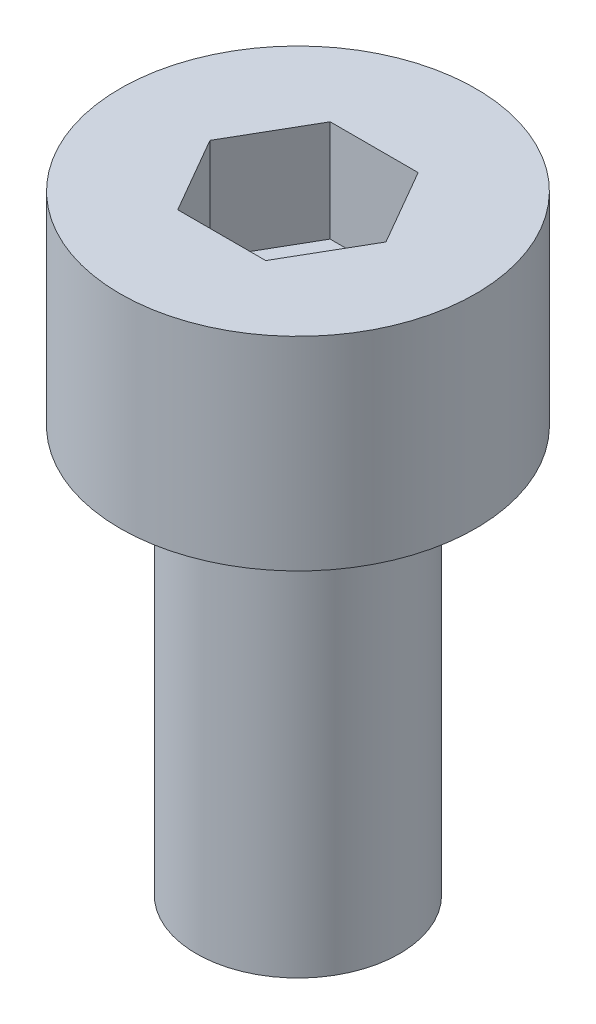
ISO-10303-21;
HEADER;
FILE_DESCRIPTION(('STEP AP214'),'2;1');
FILE_NAME('part.step','',(''),(''),'','','');
FILE_SCHEMA(('AUTOMOTIVE_DESIGN { 1 0 10303 214 1 1 1 1 }'));
ENDSEC;
DATA;
#1=APPLICATION_CONTEXT('core data for automotive mechanical design processes');
#2=APPLICATION_PROTOCOL_DEFINITION('international standard','automotive_design',2000,#1);
#3=PRODUCT_CONTEXT('',#1,'mechanical');
#4=PRODUCT('Part','Part','',(#3));
#5=PRODUCT_RELATED_PRODUCT_CATEGORY('part','',(#4));
#6=PRODUCT_DEFINITION_FORMATION('','',#4);
#7=PRODUCT_DEFINITION_CONTEXT('part definition',#1,'design');
#8=PRODUCT_DEFINITION('design','',#6,#7);
#9=PRODUCT_DEFINITION_SHAPE('','',#8);
#10=(LENGTH_UNIT() NAMED_UNIT(*) SI_UNIT(.MILLI.,.METRE.));
#11=(NAMED_UNIT(*) PLANE_ANGLE_UNIT() SI_UNIT($,.RADIAN.));
#12=(NAMED_UNIT(*) SI_UNIT($,.STERADIAN.) SOLID_ANGLE_UNIT());
#13=UNCERTAINTY_MEASURE_WITH_UNIT(LENGTH_MEASURE(1.E-05),#10,'distance_accuracy_value','');
#14=(GEOMETRIC_REPRESENTATION_CONTEXT(3) GLOBAL_UNCERTAINTY_ASSIGNED_CONTEXT((#13)) GLOBAL_UNIT_ASSIGNED_CONTEXT((#10,
#11,#12)) REPRESENTATION_CONTEXT('',''));
#15=CARTESIAN_POINT('',(0.,0.,0.));
#16=DIRECTION('',(0.,0.,1.));
#17=DIRECTION('',(1.,0.,0.));
#18=AXIS2_PLACEMENT_3D('',#15,#16,#17);
#19=CARTESIAN_POINT('',(0.,4.,0.));
#20=DIRECTION('',(0.,-1.,0.));
#21=DIRECTION('',(0.,0.,-1.));
#22=AXIS2_PLACEMENT_3D('',#19,#20,#21);
#23=CYLINDRICAL_SURFACE('',#22,3.5);
#24=CARTESIAN_POINT('',(0.,4.,0.));
#25=DIRECTION('',(0.,1.,0.));
#26=DIRECTION('',(0.,0.,1.));
#27=AXIS2_PLACEMENT_3D('',#24,#25,#26);
#28=CIRCLE('',#27,3.5);
#29=CARTESIAN_POINT('',(0.,4.,3.5));
#30=VERTEX_POINT('',#29);
#31=EDGE_CURVE('E43',#30,#30,#28,.T.);
#32=ORIENTED_EDGE('',*,*,#31,.F.);
#33=EDGE_LOOP('',(#32));
#34=FACE_BOUND('',#33,.T.);
#35=CARTESIAN_POINT('',(0.,0.,0.));
#36=DIRECTION('',(0.,1.,0.));
#37=DIRECTION('',(0.,0.,1.));
#38=AXIS2_PLACEMENT_3D('',#35,#36,#37);
#39=CIRCLE('',#38,3.5);
#40=CARTESIAN_POINT('',(0.,0.,3.5));
#41=VERTEX_POINT('',#40);
#42=EDGE_CURVE('E38',#41,#41,#39,.T.);
#43=ORIENTED_EDGE('',*,*,#42,.T.);
#44=EDGE_LOOP('',(#43));
#45=FACE_BOUND('',#44,.T.);
#46=ADVANCED_FACE('F35',(#34,#45),#23,.T.);
#47=CARTESIAN_POINT('',(0.,4.,0.));
#48=DIRECTION('',(0.,1.,0.));
#49=DIRECTION('',(0.,0.,1.));
#50=AXIS2_PLACEMENT_3D('',#47,#48,#49);
#51=PLANE('',#50);
#52=DIRECTION('',(0.5,0.,-0.866025403784439));
#53=VECTOR('',#52,1.);
#54=CARTESIAN_POINT('',(0.866025403784438,4.,1.5));
#55=LINE('',#54,#53);
#56=CARTESIAN_POINT('',(0.866025403784438,4.,1.5));
#57=VERTEX_POINT('',#56);
#58=CARTESIAN_POINT('',(1.73205080756888,4.,0.));
#59=VERTEX_POINT('',#58);
#60=EDGE_CURVE('E51',#57,#59,#55,.T.);
#61=ORIENTED_EDGE('',*,*,#60,.F.);
#62=DIRECTION('',(1.,0.,0.));
#63=VECTOR('',#62,1.);
#64=CARTESIAN_POINT('',(-0.866025403784439,4.,1.5));
#65=LINE('',#64,#63);
#66=CARTESIAN_POINT('',(-0.866025403784439,4.,1.5));
#67=VERTEX_POINT('',#66);
#68=EDGE_CURVE('E135',#67,#57,#65,.T.);
#69=ORIENTED_EDGE('',*,*,#68,.F.);
#70=DIRECTION('',(0.5,0.,0.866025403784438));
#71=VECTOR('',#70,1.);
#72=CARTESIAN_POINT('',(-1.73205080756888,4.,0.));
#73=LINE('',#72,#71);
#74=CARTESIAN_POINT('',(-1.73205080756888,4.,0.));
#75=VERTEX_POINT('',#74);
#76=EDGE_CURVE('E133',#75,#67,#73,.T.);
#77=ORIENTED_EDGE('',*,*,#76,.F.);
#78=DIRECTION('',(-0.5,0.,0.866025403784439));
#79=VECTOR('',#78,1.);
#80=CARTESIAN_POINT('',(-0.866025403784439,4.,-1.5));
#81=LINE('',#80,#79);
#82=CARTESIAN_POINT('',(-0.866025403784439,4.,-1.5));
#83=VERTEX_POINT('',#82);
#84=EDGE_CURVE('E99',#83,#75,#81,.T.);
#85=ORIENTED_EDGE('',*,*,#84,.F.);
#86=DIRECTION('',(-1.,0.,0.));
#87=VECTOR('',#86,1.);
#88=CARTESIAN_POINT('',(0.866025403784438,4.,-1.5));
#89=LINE('',#88,#87);
#90=CARTESIAN_POINT('',(0.866025403784438,4.,-1.5));
#91=VERTEX_POINT('',#90);
#92=EDGE_CURVE('E129',#91,#83,#89,.T.);
#93=ORIENTED_EDGE('',*,*,#92,.F.);
#94=DIRECTION('',(-0.5,0.,-0.866025403784439));
#95=VECTOR('',#94,1.);
#96=CARTESIAN_POINT('',(1.73205080756888,4.,0.));
#97=LINE('',#96,#95);
#98=EDGE_CURVE('E125',#59,#91,#97,.T.);
#99=ORIENTED_EDGE('',*,*,#98,.F.);
#100=EDGE_LOOP('',(#61,#69,#77,#85,#93,#99));
#101=FACE_BOUND('',#100,.T.);
#102=ORIENTED_EDGE('',*,*,#31,.T.);
#103=EDGE_LOOP('',(#102));
#104=FACE_BOUND('',#103,.T.);
#105=ADVANCED_FACE('F153',(#101,#104),#51,.T.);
#106=CARTESIAN_POINT('',(0.,0.,0.));
#107=DIRECTION('',(0.,1.,0.));
#108=DIRECTION('',(0.,0.,1.));
#109=AXIS2_PLACEMENT_3D('',#106,#107,#108);
#110=PLANE('',#109);
#111=CARTESIAN_POINT('',(0.,0.,0.));
#112=DIRECTION('',(0.,-1.,0.));
#113=DIRECTION('',(0.,0.,-1.));
#114=AXIS2_PLACEMENT_3D('',#111,#112,#113);
#115=CIRCLE('',#114,2.);
#116=CARTESIAN_POINT('',(0.,0.,-2.));
#117=VERTEX_POINT('',#116);
#118=EDGE_CURVE('E11',#117,#117,#115,.T.);
#119=ORIENTED_EDGE('',*,*,#118,.F.);
#120=EDGE_LOOP('',(#119));
#121=FACE_BOUND('',#120,.T.);
#122=ORIENTED_EDGE('',*,*,#42,.F.);
#123=EDGE_LOOP('',(#122));
#124=FACE_BOUND('',#123,.T.);
#125=ADVANCED_FACE('F150',(#121,#124),#110,.F.);
#126=CARTESIAN_POINT('',(0.866025403784438,2.,1.5));
#127=DIRECTION('',(0.866025403784439,0.,0.5));
#128=DIRECTION('',(0.5,0.,-0.866025403784439));
#129=AXIS2_PLACEMENT_3D('',#126,#127,#128);
#130=PLANE('',#129);
#131=ORIENTED_EDGE('',*,*,#60,.T.);
#132=DIRECTION('',(0.,1.,0.));
#133=VECTOR('',#132,1.);
#134=CARTESIAN_POINT('',(1.73205080756888,2.,0.));
#135=LINE('',#134,#133);
#136=CARTESIAN_POINT('',(1.73205080756888,2.,0.));
#137=VERTEX_POINT('',#136);
#138=EDGE_CURVE('E81',#137,#59,#135,.T.);
#139=ORIENTED_EDGE('',*,*,#138,.F.);
#140=DIRECTION('',(0.5,0.,-0.866025403784439));
#141=VECTOR('',#140,1.);
#142=CARTESIAN_POINT('',(0.866025403784438,2.,1.5));
#143=LINE('',#142,#141);
#144=CARTESIAN_POINT('',(0.866025403784438,2.,1.5));
#145=VERTEX_POINT('',#144);
#146=EDGE_CURVE('E137',#145,#137,#143,.T.);
#147=ORIENTED_EDGE('',*,*,#146,.F.);
#148=DIRECTION('',(0.,1.,0.));
#149=VECTOR('',#148,1.);
#150=CARTESIAN_POINT('',(0.866025403784438,2.,1.5));
#151=LINE('',#150,#149);
#152=EDGE_CURVE('E59',#145,#57,#151,.T.);
#153=ORIENTED_EDGE('',*,*,#152,.T.);
#154=EDGE_LOOP('',(#131,#139,#147,#153));
#155=FACE_BOUND('',#154,.T.);
#156=ADVANCED_FACE('F152',(#155),#130,.F.);
#157=CARTESIAN_POINT('',(-0.866025403784439,2.,1.5));
#158=DIRECTION('',(0.,0.,1.));
#159=DIRECTION('',(1.,0.,0.));
#160=AXIS2_PLACEMENT_3D('',#157,#158,#159);
#161=PLANE('',#160);
#162=ORIENTED_EDGE('',*,*,#68,.T.);
#163=ORIENTED_EDGE('',*,*,#152,.F.);
#164=DIRECTION('',(1.,0.,0.));
#165=VECTOR('',#164,1.);
#166=CARTESIAN_POINT('',(-0.866025403784439,2.,1.5));
#167=LINE('',#166,#165);
#168=CARTESIAN_POINT('',(-0.866025403784439,2.,1.5));
#169=VERTEX_POINT('',#168);
#170=EDGE_CURVE('E111',#169,#145,#167,.T.);
#171=ORIENTED_EDGE('',*,*,#170,.F.);
#172=DIRECTION('',(0.,1.,0.));
#173=VECTOR('',#172,1.);
#174=CARTESIAN_POINT('',(-0.866025403784439,2.,1.5));
#175=LINE('',#174,#173);
#176=EDGE_CURVE('E103',#169,#67,#175,.T.);
#177=ORIENTED_EDGE('',*,*,#176,.T.);
#178=EDGE_LOOP('',(#162,#163,#171,#177));
#179=FACE_BOUND('',#178,.T.);
#180=ADVANCED_FACE('F159',(#179),#161,.F.);
#181=CARTESIAN_POINT('',(-1.73205080756888,2.,0.));
#182=DIRECTION('',(-0.866025403784439,0.,0.5));
#183=DIRECTION('',(0.5,0.,0.866025403784438));
#184=AXIS2_PLACEMENT_3D('',#181,#182,#183);
#185=PLANE('',#184);
#186=ORIENTED_EDGE('',*,*,#76,.T.);
#187=ORIENTED_EDGE('',*,*,#176,.F.);
#188=DIRECTION('',(0.5,0.,0.866025403784438));
#189=VECTOR('',#188,1.);
#190=CARTESIAN_POINT('',(-1.73205080756888,2.,0.));
#191=LINE('',#190,#189);
#192=CARTESIAN_POINT('',(-1.73205080756888,2.,0.));
#193=VERTEX_POINT('',#192);
#194=EDGE_CURVE('E107',#193,#169,#191,.T.);
#195=ORIENTED_EDGE('',*,*,#194,.F.);
#196=DIRECTION('',(0.,1.,0.));
#197=VECTOR('',#196,1.);
#198=CARTESIAN_POINT('',(-1.73205080756888,2.,0.));
#199=LINE('',#198,#197);
#200=EDGE_CURVE('E92',#193,#75,#199,.T.);
#201=ORIENTED_EDGE('',*,*,#200,.T.);
#202=EDGE_LOOP('',(#186,#187,#195,#201));
#203=FACE_BOUND('',#202,.T.);
#204=ADVANCED_FACE('F108',(#203),#185,.F.);
#205=CARTESIAN_POINT('',(-0.866025403784439,2.,-1.5));
#206=DIRECTION('',(-0.866025403784439,0.,-0.5));
#207=DIRECTION('',(-0.5,0.,0.866025403784439));
#208=AXIS2_PLACEMENT_3D('',#205,#206,#207);
#209=PLANE('',#208);
#210=ORIENTED_EDGE('',*,*,#84,.T.);
#211=ORIENTED_EDGE('',*,*,#200,.F.);
#212=DIRECTION('',(-0.5,0.,0.866025403784439));
#213=VECTOR('',#212,1.);
#214=CARTESIAN_POINT('',(-0.866025403784439,2.,-1.5));
#215=LINE('',#214,#213);
#216=CARTESIAN_POINT('',(-0.866025403784439,2.,-1.5));
#217=VERTEX_POINT('',#216);
#218=EDGE_CURVE('E96',#217,#193,#215,.T.);
#219=ORIENTED_EDGE('',*,*,#218,.F.);
#220=DIRECTION('',(0.,1.,0.));
#221=VECTOR('',#220,1.);
#222=CARTESIAN_POINT('',(-0.866025403784439,2.,-1.5));
#223=LINE('',#222,#221);
#224=EDGE_CURVE('E104',#217,#83,#223,.T.);
#225=ORIENTED_EDGE('',*,*,#224,.T.);
#226=EDGE_LOOP('',(#210,#211,#219,#225));
#227=FACE_BOUND('',#226,.T.);
#228=ADVANCED_FACE('F94',(#227),#209,.F.);
#229=CARTESIAN_POINT('',(0.866025403784438,2.,-1.5));
#230=DIRECTION('',(0.,0.,-1.));
#231=DIRECTION('',(-1.,0.,0.));
#232=AXIS2_PLACEMENT_3D('',#229,#230,#231);
#233=PLANE('',#232);
#234=ORIENTED_EDGE('',*,*,#92,.T.);
#235=ORIENTED_EDGE('',*,*,#224,.F.);
#236=DIRECTION('',(-1.,0.,0.));
#237=VECTOR('',#236,1.);
#238=CARTESIAN_POINT('',(0.866025403784438,2.,-1.5));
#239=LINE('',#238,#237);
#240=CARTESIAN_POINT('',(0.866025403784438,2.,-1.5));
#241=VERTEX_POINT('',#240);
#242=EDGE_CURVE('E117',#241,#217,#239,.T.);
#243=ORIENTED_EDGE('',*,*,#242,.F.);
#244=DIRECTION('',(0.,1.,0.));
#245=VECTOR('',#244,1.);
#246=CARTESIAN_POINT('',(0.866025403784438,2.,-1.5));
#247=LINE('',#246,#245);
#248=EDGE_CURVE('E141',#241,#91,#247,.T.);
#249=ORIENTED_EDGE('',*,*,#248,.T.);
#250=EDGE_LOOP('',(#234,#235,#243,#249));
#251=FACE_BOUND('',#250,.T.);
#252=ADVANCED_FACE('F204',(#251),#233,.F.);
#253=CARTESIAN_POINT('',(1.73205080756888,2.,0.));
#254=DIRECTION('',(0.866025403784439,0.,-0.5));
#255=DIRECTION('',(-0.5,0.,-0.866025403784439));
#256=AXIS2_PLACEMENT_3D('',#253,#254,#255);
#257=PLANE('',#256);
#258=ORIENTED_EDGE('',*,*,#98,.T.);
#259=ORIENTED_EDGE('',*,*,#248,.F.);
#260=DIRECTION('',(-0.5,0.,-0.866025403784439));
#261=VECTOR('',#260,1.);
#262=CARTESIAN_POINT('',(1.73205080756888,2.,0.));
#263=LINE('',#262,#261);
#264=EDGE_CURVE('E119',#137,#241,#263,.T.);
#265=ORIENTED_EDGE('',*,*,#264,.F.);
#266=ORIENTED_EDGE('',*,*,#138,.T.);
#267=EDGE_LOOP('',(#258,#259,#265,#266));
#268=FACE_BOUND('',#267,.T.);
#269=ADVANCED_FACE('F213',(#268),#257,.F.);
#270=CARTESIAN_POINT('',(0.,2.,0.));
#271=DIRECTION('',(0.,1.,0.));
#272=DIRECTION('',(0.,0.,1.));
#273=AXIS2_PLACEMENT_3D('',#270,#271,#272);
#274=PLANE('',#273);
#275=ORIENTED_EDGE('',*,*,#146,.T.);
#276=ORIENTED_EDGE('',*,*,#264,.T.);
#277=ORIENTED_EDGE('',*,*,#242,.T.);
#278=ORIENTED_EDGE('',*,*,#218,.T.);
#279=ORIENTED_EDGE('',*,*,#194,.T.);
#280=ORIENTED_EDGE('',*,*,#170,.T.);
#281=EDGE_LOOP('',(#275,#276,#277,#278,#279,#280));
#282=FACE_BOUND('',#281,.T.);
#283=ADVANCED_FACE('F114',(#282),#274,.T.);
#284=CARTESIAN_POINT('',(0.,-8.,0.));
#285=DIRECTION('',(0.,1.,0.));
#286=DIRECTION('',(0.,0.,1.));
#287=AXIS2_PLACEMENT_3D('',#284,#285,#286);
#288=CYLINDRICAL_SURFACE('',#287,2.);
#289=CARTESIAN_POINT('',(0.,-8.,0.));
#290=DIRECTION('',(0.,-1.,0.));
#291=DIRECTION('',(0.,0.,-1.));
#292=AXIS2_PLACEMENT_3D('',#289,#290,#291);
#293=CIRCLE('',#292,2.);
#294=CARTESIAN_POINT('',(0.,-8.,-2.));
#295=VERTEX_POINT('',#294);
#296=EDGE_CURVE('E126',#295,#295,#293,.T.);
#297=ORIENTED_EDGE('',*,*,#296,.F.);
#298=EDGE_LOOP('',(#297));
#299=FACE_BOUND('',#298,.T.);
#300=ORIENTED_EDGE('',*,*,#118,.T.);
#301=EDGE_LOOP('',(#300));
#302=FACE_BOUND('',#301,.T.);
#303=ADVANCED_FACE('F231',(#299,#302),#288,.T.);
#304=CARTESIAN_POINT('',(0.,-8.,0.));
#305=DIRECTION('',(0.,-1.,0.));
#306=DIRECTION('',(0.,0.,-1.));
#307=AXIS2_PLACEMENT_3D('',#304,#305,#306);
#308=PLANE('',#307);
#309=ORIENTED_EDGE('',*,*,#296,.T.);
#310=EDGE_LOOP('',(#309));
#311=FACE_BOUND('',#310,.T.);
#312=ADVANCED_FACE('F244',(#311),#308,.T.);
#313=CLOSED_SHELL('',(#46,#105,#125,#156,#180,#204,#228,#252,#269,#283,#303,#312));
#314=MANIFOLD_SOLID_BREP('B2',#313);
#315=ADVANCED_BREP_SHAPE_REPRESENTATION('',(#18,#314),#14);
#316=SHAPE_DEFINITION_REPRESENTATION(#9,#315);
ENDSEC;
END-ISO-10303-21;
